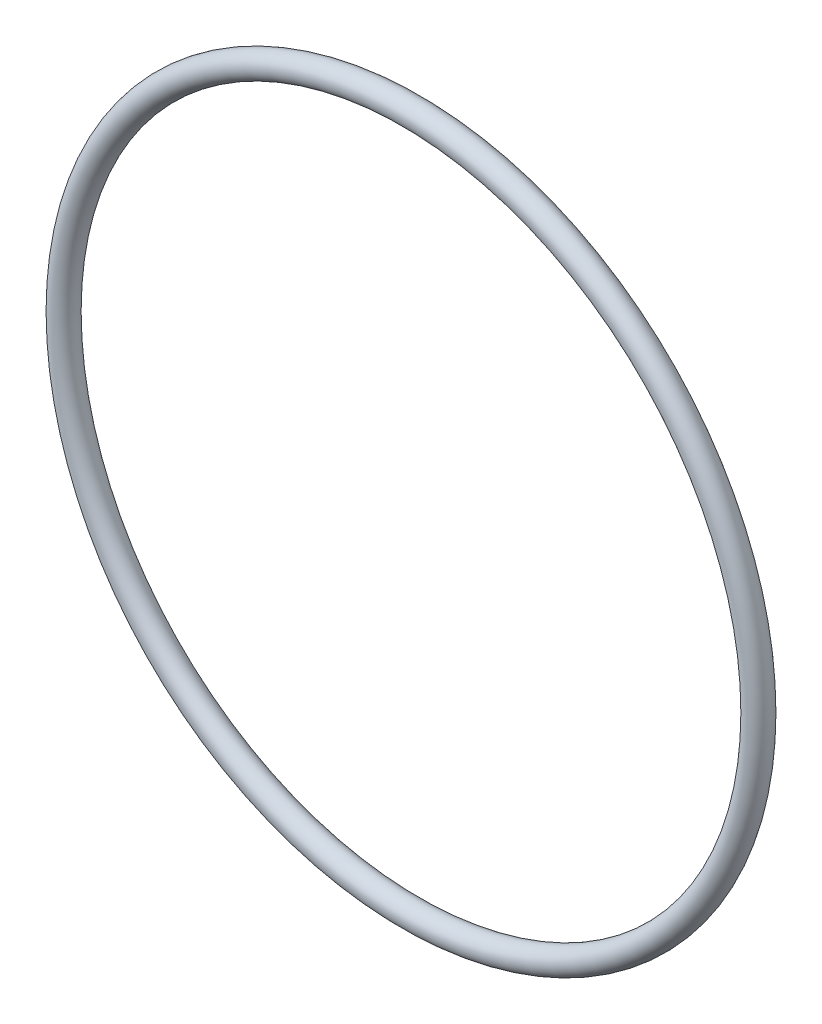
ISO-10303-21;
HEADER;
FILE_DESCRIPTION(('STEP AP214'),'2;1');
FILE_NAME('part.step','',(''),(''),'','','');
FILE_SCHEMA(('AUTOMOTIVE_DESIGN { 1 0 10303 214 1 1 1 1 }'));
ENDSEC;
DATA;
#1=APPLICATION_CONTEXT('core data for automotive mechanical design processes');
#2=APPLICATION_PROTOCOL_DEFINITION('international standard','automotive_design',2000,#1);
#3=PRODUCT_CONTEXT('',#1,'mechanical');
#4=PRODUCT('Part','Part','',(#3));
#5=PRODUCT_RELATED_PRODUCT_CATEGORY('part','',(#4));
#6=PRODUCT_DEFINITION_FORMATION('','',#4);
#7=PRODUCT_DEFINITION_CONTEXT('part definition',#1,'design');
#8=PRODUCT_DEFINITION('design','',#6,#7);
#9=PRODUCT_DEFINITION_SHAPE('','',#8);
#10=(LENGTH_UNIT() NAMED_UNIT(*) SI_UNIT(.MILLI.,.METRE.));
#11=(NAMED_UNIT(*) PLANE_ANGLE_UNIT() SI_UNIT($,.RADIAN.));
#12=(NAMED_UNIT(*) SI_UNIT($,.STERADIAN.) SOLID_ANGLE_UNIT());
#13=UNCERTAINTY_MEASURE_WITH_UNIT(LENGTH_MEASURE(1.E-05),#10,'distance_accuracy_value','');
#14=(GEOMETRIC_REPRESENTATION_CONTEXT(3) GLOBAL_UNCERTAINTY_ASSIGNED_CONTEXT((#13)) GLOBAL_UNIT_ASSIGNED_CONTEXT((#10,
#11,#12)) REPRESENTATION_CONTEXT('',''));
#15=CARTESIAN_POINT('',(0.,0.,0.));
#16=DIRECTION('',(0.,0.,1.));
#17=DIRECTION('',(1.,0.,0.));
#18=AXIS2_PLACEMENT_3D('',#15,#16,#17);
#19=CARTESIAN_POINT('',(0.,0.,1.4));
#20=DIRECTION('',(0.,0.,-1.));
#21=DIRECTION('',(-1.,0.,0.));
#22=AXIS2_PLACEMENT_3D('',#19,#20,#21);
#23=TOROIDAL_SURFACE('',#22,1.4,0.0499999999999999);
#24=CARTESIAN_POINT('',(-1.45,0.,1.4));
#25=VERTEX_POINT('',#24);
#26=VERTEX_LOOP('',#25);
#27=FACE_BOUND('',#26,.T.);
#28=ADVANCED_FACE('F13',(#27),#23,.T.);
#29=CLOSED_SHELL('',(#28));
#30=MANIFOLD_SOLID_BREP('B1',#29);
#31=ADVANCED_BREP_SHAPE_REPRESENTATION('',(#18,#30),#14);
#32=SHAPE_DEFINITION_REPRESENTATION(#9,#31);
ENDSEC;
END-ISO-10303-21;
